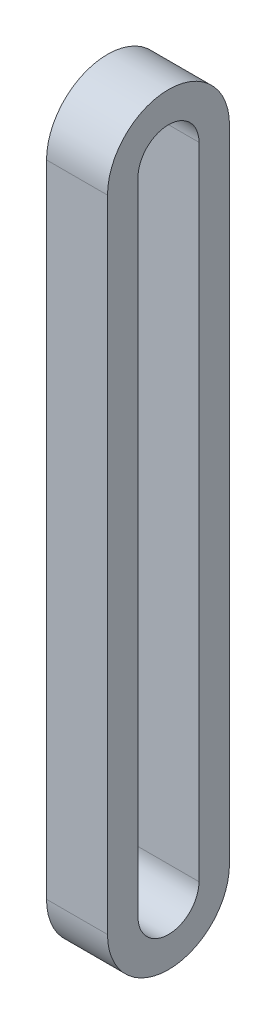
ISO-10303-21;
HEADER;
FILE_DESCRIPTION(('STEP AP214'),'2;1');
FILE_NAME('part.step','',(''),(''),'','','');
FILE_SCHEMA(('AUTOMOTIVE_DESIGN { 1 0 10303 214 1 1 1 1 }'));
ENDSEC;
DATA;
#1=APPLICATION_CONTEXT('core data for automotive mechanical design processes');
#2=APPLICATION_PROTOCOL_DEFINITION('international standard','automotive_design',2000,#1);
#3=PRODUCT_CONTEXT('',#1,'mechanical');
#4=PRODUCT('Part','Part','',(#3));
#5=PRODUCT_RELATED_PRODUCT_CATEGORY('part','',(#4));
#6=PRODUCT_DEFINITION_FORMATION('','',#4);
#7=PRODUCT_DEFINITION_CONTEXT('part definition',#1,'design');
#8=PRODUCT_DEFINITION('design','',#6,#7);
#9=PRODUCT_DEFINITION_SHAPE('','',#8);
#10=(LENGTH_UNIT() NAMED_UNIT(*) SI_UNIT(.MILLI.,.METRE.));
#11=(NAMED_UNIT(*) PLANE_ANGLE_UNIT() SI_UNIT($,.RADIAN.));
#12=(NAMED_UNIT(*) SI_UNIT($,.STERADIAN.) SOLID_ANGLE_UNIT());
#13=UNCERTAINTY_MEASURE_WITH_UNIT(LENGTH_MEASURE(1.E-05),#10,'distance_accuracy_value','');
#14=(GEOMETRIC_REPRESENTATION_CONTEXT(3) GLOBAL_UNCERTAINTY_ASSIGNED_CONTEXT((#13)) GLOBAL_UNIT_ASSIGNED_CONTEXT((#10,
#11,#12)) REPRESENTATION_CONTEXT('',''));
#15=CARTESIAN_POINT('',(0.,0.,0.));
#16=DIRECTION('',(0.,0.,1.));
#17=DIRECTION('',(1.,0.,0.));
#18=AXIS2_PLACEMENT_3D('',#15,#16,#17);
#19=CARTESIAN_POINT('',(30.,25.,0.));
#20=DIRECTION('',(1.,0.,0.));
#21=DIRECTION('',(0.,1.,0.));
#22=AXIS2_PLACEMENT_3D('',#19,#20,#21);
#23=PLANE('',#22);
#24=DIRECTION('',(0.,-1.,0.));
#25=VECTOR('',#24,1.);
#26=CARTESIAN_POINT('',(30.,130.,-10.));
#27=LINE('',#26,#25);
#28=CARTESIAN_POINT('',(30.,130.,-10.));
#29=VERTEX_POINT('',#28);
#30=CARTESIAN_POINT('',(30.,25.,-10.));
#31=VERTEX_POINT('',#30);
#32=EDGE_CURVE('E161',#29,#31,#27,.T.);
#33=ORIENTED_EDGE('',*,*,#32,.F.);
#34=CARTESIAN_POINT('',(30.,130.,0.));
#35=DIRECTION('',(1.,0.,0.));
#36=DIRECTION('',(0.,1.,0.));
#37=AXIS2_PLACEMENT_3D('',#34,#35,#36);
#38=CIRCLE('',#37,10.);
#39=CARTESIAN_POINT('',(30.,130.,10.));
#40=VERTEX_POINT('',#39);
#41=EDGE_CURVE('E169',#29,#40,#38,.T.);
#42=ORIENTED_EDGE('',*,*,#41,.T.);
#43=DIRECTION('',(0.,-1.,0.));
#44=VECTOR('',#43,1.);
#45=CARTESIAN_POINT('',(30.,130.,10.));
#46=LINE('',#45,#44);
#47=CARTESIAN_POINT('',(30.,25.,9.99999999999998));
#48=VERTEX_POINT('',#47);
#49=EDGE_CURVE('E167',#40,#48,#46,.T.);
#50=ORIENTED_EDGE('',*,*,#49,.T.);
#51=CARTESIAN_POINT('',(30.,25.,0.));
#52=DIRECTION('',(1.,0.,0.));
#53=DIRECTION('',(0.,1.,0.));
#54=AXIS2_PLACEMENT_3D('',#51,#52,#53);
#55=CIRCLE('',#54,10.);
#56=EDGE_CURVE('E164',#48,#31,#55,.T.);
#57=ORIENTED_EDGE('',*,*,#56,.T.);
#58=EDGE_LOOP('',(#33,#42,#50,#57));
#59=FACE_BOUND('',#58,.T.);
#60=DIRECTION('',(0.,-1.,0.));
#61=VECTOR('',#60,1.);
#62=CARTESIAN_POINT('',(30.,130.,5.));
#63=LINE('',#62,#61);
#64=CARTESIAN_POINT('',(30.,130.,5.));
#65=VERTEX_POINT('',#64);
#66=CARTESIAN_POINT('',(30.,25.,4.99999999999999));
#67=VERTEX_POINT('',#66);
#68=EDGE_CURVE('E134',#65,#67,#63,.T.);
#69=ORIENTED_EDGE('',*,*,#68,.F.);
#70=CARTESIAN_POINT('',(30.,130.,0.));
#71=DIRECTION('',(1.,0.,0.));
#72=DIRECTION('',(0.,1.,0.));
#73=AXIS2_PLACEMENT_3D('',#70,#71,#72);
#74=CIRCLE('',#73,5.);
#75=CARTESIAN_POINT('',(30.,130.,-5.));
#76=VERTEX_POINT('',#75);
#77=EDGE_CURVE('E126',#76,#65,#74,.T.);
#78=ORIENTED_EDGE('',*,*,#77,.F.);
#79=DIRECTION('',(0.,-1.,0.));
#80=VECTOR('',#79,1.);
#81=CARTESIAN_POINT('',(30.,130.,-5.));
#82=LINE('',#81,#80);
#83=CARTESIAN_POINT('',(30.,25.,-5.00000000000002));
#84=VERTEX_POINT('',#83);
#85=EDGE_CURVE('E148',#76,#84,#82,.T.);
#86=ORIENTED_EDGE('',*,*,#85,.T.);
#87=CARTESIAN_POINT('',(30.,25.,0.));
#88=DIRECTION('',(1.,0.,0.));
#89=DIRECTION('',(0.,1.,0.));
#90=AXIS2_PLACEMENT_3D('',#87,#88,#89);
#91=CIRCLE('',#90,5.);
#92=EDGE_CURVE('E146',#67,#84,#91,.T.);
#93=ORIENTED_EDGE('',*,*,#92,.F.);
#94=EDGE_LOOP('',(#69,#78,#86,#93));
#95=FACE_BOUND('',#94,.T.);
#96=ADVANCED_FACE('F60',(#59,#95),#23,.T.);
#97=CARTESIAN_POINT('',(20.,25.,0.));
#98=DIRECTION('',(1.,0.,0.));
#99=DIRECTION('',(0.,1.,0.));
#100=AXIS2_PLACEMENT_3D('',#97,#98,#99);
#101=PLANE('',#100);
#102=DIRECTION('',(0.,-1.,0.));
#103=VECTOR('',#102,1.);
#104=CARTESIAN_POINT('',(20.,130.,-10.));
#105=LINE('',#104,#103);
#106=CARTESIAN_POINT('',(20.,130.,-10.));
#107=VERTEX_POINT('',#106);
#108=CARTESIAN_POINT('',(20.,25.,-10.));
#109=VERTEX_POINT('',#108);
#110=EDGE_CURVE('E142',#107,#109,#105,.T.);
#111=ORIENTED_EDGE('',*,*,#110,.T.);
#112=CARTESIAN_POINT('',(20.,25.,0.));
#113=DIRECTION('',(1.,0.,0.));
#114=DIRECTION('',(0.,1.,0.));
#115=AXIS2_PLACEMENT_3D('',#112,#113,#114);
#116=CIRCLE('',#115,10.);
#117=CARTESIAN_POINT('',(20.,25.,9.99999999999998));
#118=VERTEX_POINT('',#117);
#119=EDGE_CURVE('E173',#118,#109,#116,.T.);
#120=ORIENTED_EDGE('',*,*,#119,.F.);
#121=DIRECTION('',(0.,-1.,0.));
#122=VECTOR('',#121,1.);
#123=CARTESIAN_POINT('',(20.,130.,10.));
#124=LINE('',#123,#122);
#125=CARTESIAN_POINT('',(20.,130.,10.));
#126=VERTEX_POINT('',#125);
#127=EDGE_CURVE('E176',#126,#118,#124,.T.);
#128=ORIENTED_EDGE('',*,*,#127,.F.);
#129=CARTESIAN_POINT('',(20.,130.,0.));
#130=DIRECTION('',(1.,0.,0.));
#131=DIRECTION('',(0.,1.,0.));
#132=AXIS2_PLACEMENT_3D('',#129,#130,#131);
#133=CIRCLE('',#132,10.);
#134=EDGE_CURVE('E165',#107,#126,#133,.T.);
#135=ORIENTED_EDGE('',*,*,#134,.F.);
#136=EDGE_LOOP('',(#111,#120,#128,#135));
#137=FACE_BOUND('',#136,.T.);
#138=CARTESIAN_POINT('',(20.,130.,0.));
#139=DIRECTION('',(1.,0.,0.));
#140=DIRECTION('',(0.,1.,0.));
#141=AXIS2_PLACEMENT_3D('',#138,#139,#140);
#142=CIRCLE('',#141,5.);
#143=CARTESIAN_POINT('',(20.,130.,-5.));
#144=VERTEX_POINT('',#143);
#145=CARTESIAN_POINT('',(20.,130.,5.));
#146=VERTEX_POINT('',#145);
#147=EDGE_CURVE('E85',#144,#146,#142,.T.);
#148=ORIENTED_EDGE('',*,*,#147,.T.);
#149=DIRECTION('',(0.,-1.,0.));
#150=VECTOR('',#149,1.);
#151=CARTESIAN_POINT('',(20.,130.,5.));
#152=LINE('',#151,#150);
#153=CARTESIAN_POINT('',(20.,25.,4.99999999999999));
#154=VERTEX_POINT('',#153);
#155=EDGE_CURVE('E141',#146,#154,#152,.T.);
#156=ORIENTED_EDGE('',*,*,#155,.T.);
#157=CARTESIAN_POINT('',(20.,25.,0.));
#158=DIRECTION('',(1.,0.,0.));
#159=DIRECTION('',(0.,1.,0.));
#160=AXIS2_PLACEMENT_3D('',#157,#158,#159);
#161=CIRCLE('',#160,5.);
#162=CARTESIAN_POINT('',(20.,25.,-5.00000000000002));
#163=VERTEX_POINT('',#162);
#164=EDGE_CURVE('E154',#154,#163,#161,.T.);
#165=ORIENTED_EDGE('',*,*,#164,.T.);
#166=DIRECTION('',(0.,-1.,0.));
#167=VECTOR('',#166,1.);
#168=CARTESIAN_POINT('',(20.,130.,-5.));
#169=LINE('',#168,#167);
#170=EDGE_CURVE('E135',#144,#163,#169,.T.);
#171=ORIENTED_EDGE('',*,*,#170,.F.);
#172=EDGE_LOOP('',(#148,#156,#165,#171));
#173=FACE_BOUND('',#172,.T.);
#174=ADVANCED_FACE('F194',(#137,#173),#101,.F.);
#175=CARTESIAN_POINT('',(30.,130.,-10.));
#176=DIRECTION('',(0.,0.,-1.));
#177=DIRECTION('',(0.,1.,0.));
#178=AXIS2_PLACEMENT_3D('',#175,#176,#177);
#179=PLANE('',#178);
#180=ORIENTED_EDGE('',*,*,#110,.F.);
#181=DIRECTION('',(-1.,0.,0.));
#182=VECTOR('',#181,1.);
#183=CARTESIAN_POINT('',(30.,130.,-10.));
#184=LINE('',#183,#182);
#185=EDGE_CURVE('E12',#29,#107,#184,.T.);
#186=ORIENTED_EDGE('',*,*,#185,.F.);
#187=ORIENTED_EDGE('',*,*,#32,.T.);
#188=DIRECTION('',(-1.,0.,0.));
#189=VECTOR('',#188,1.);
#190=CARTESIAN_POINT('',(30.,25.,-10.));
#191=LINE('',#190,#189);
#192=EDGE_CURVE('E64',#31,#109,#191,.T.);
#193=ORIENTED_EDGE('',*,*,#192,.T.);
#194=EDGE_LOOP('',(#180,#186,#187,#193));
#195=FACE_BOUND('',#194,.T.);
#196=ADVANCED_FACE('F62',(#195),#179,.T.);
#197=CARTESIAN_POINT('',(30.,130.,0.));
#198=DIRECTION('',(-1.,0.,0.));
#199=DIRECTION('',(0.,-1.,0.));
#200=AXIS2_PLACEMENT_3D('',#197,#198,#199);
#201=CYLINDRICAL_SURFACE('',#200,10.);
#202=ORIENTED_EDGE('',*,*,#134,.T.);
#203=DIRECTION('',(-1.,0.,0.));
#204=VECTOR('',#203,1.);
#205=CARTESIAN_POINT('',(30.,130.,10.));
#206=LINE('',#205,#204);
#207=EDGE_CURVE('E69',#40,#126,#206,.T.);
#208=ORIENTED_EDGE('',*,*,#207,.F.);
#209=ORIENTED_EDGE('',*,*,#41,.F.);
#210=ORIENTED_EDGE('',*,*,#185,.T.);
#211=EDGE_LOOP('',(#202,#208,#209,#210));
#212=FACE_BOUND('',#211,.T.);
#213=ADVANCED_FACE('F198',(#212),#201,.T.);
#214=CARTESIAN_POINT('',(30.,130.,10.));
#215=DIRECTION('',(0.,0.,-1.));
#216=DIRECTION('',(0.,1.,0.));
#217=AXIS2_PLACEMENT_3D('',#214,#215,#216);
#218=PLANE('',#217);
#219=ORIENTED_EDGE('',*,*,#127,.T.);
#220=DIRECTION('',(-1.,0.,0.));
#221=VECTOR('',#220,1.);
#222=CARTESIAN_POINT('',(30.,25.,9.99999999999998));
#223=LINE('',#222,#221);
#224=EDGE_CURVE('E180',#48,#118,#223,.T.);
#225=ORIENTED_EDGE('',*,*,#224,.F.);
#226=ORIENTED_EDGE('',*,*,#49,.F.);
#227=ORIENTED_EDGE('',*,*,#207,.T.);
#228=EDGE_LOOP('',(#219,#225,#226,#227));
#229=FACE_BOUND('',#228,.T.);
#230=ADVANCED_FACE('F202',(#229),#218,.F.);
#231=CARTESIAN_POINT('',(30.,25.,0.));
#232=DIRECTION('',(-1.,0.,0.));
#233=DIRECTION('',(0.,-1.,0.));
#234=AXIS2_PLACEMENT_3D('',#231,#232,#233);
#235=CYLINDRICAL_SURFACE('',#234,10.);
#236=ORIENTED_EDGE('',*,*,#119,.T.);
#237=ORIENTED_EDGE('',*,*,#192,.F.);
#238=ORIENTED_EDGE('',*,*,#56,.F.);
#239=ORIENTED_EDGE('',*,*,#224,.T.);
#240=EDGE_LOOP('',(#236,#237,#238,#239));
#241=FACE_BOUND('',#240,.T.);
#242=ADVANCED_FACE('F190',(#241),#235,.T.);
#243=CARTESIAN_POINT('',(30.,130.,0.));
#244=DIRECTION('',(-1.,0.,0.));
#245=DIRECTION('',(0.,-1.,0.));
#246=AXIS2_PLACEMENT_3D('',#243,#244,#245);
#247=CYLINDRICAL_SURFACE('',#246,5.);
#248=ORIENTED_EDGE('',*,*,#147,.F.);
#249=DIRECTION('',(-1.,0.,0.));
#250=VECTOR('',#249,1.);
#251=CARTESIAN_POINT('',(30.,130.,-5.));
#252=LINE('',#251,#250);
#253=EDGE_CURVE('E130',#76,#144,#252,.T.);
#254=ORIENTED_EDGE('',*,*,#253,.F.);
#255=ORIENTED_EDGE('',*,*,#77,.T.);
#256=DIRECTION('',(-1.,0.,0.));
#257=VECTOR('',#256,1.);
#258=CARTESIAN_POINT('',(30.,130.,5.));
#259=LINE('',#258,#257);
#260=EDGE_CURVE('E129',#65,#146,#259,.T.);
#261=ORIENTED_EDGE('',*,*,#260,.T.);
#262=EDGE_LOOP('',(#248,#254,#255,#261));
#263=FACE_BOUND('',#262,.T.);
#264=ADVANCED_FACE('F128',(#263),#247,.F.);
#265=CARTESIAN_POINT('',(30.,130.,5.));
#266=DIRECTION('',(0.,0.,-1.));
#267=DIRECTION('',(0.,1.,0.));
#268=AXIS2_PLACEMENT_3D('',#265,#266,#267);
#269=PLANE('',#268);
#270=ORIENTED_EDGE('',*,*,#155,.F.);
#271=ORIENTED_EDGE('',*,*,#260,.F.);
#272=ORIENTED_EDGE('',*,*,#68,.T.);
#273=DIRECTION('',(-1.,0.,0.));
#274=VECTOR('',#273,1.);
#275=CARTESIAN_POINT('',(30.,25.,4.99999999999999));
#276=LINE('',#275,#274);
#277=EDGE_CURVE('E143',#67,#154,#276,.T.);
#278=ORIENTED_EDGE('',*,*,#277,.T.);
#279=EDGE_LOOP('',(#270,#271,#272,#278));
#280=FACE_BOUND('',#279,.T.);
#281=ADVANCED_FACE('F138',(#280),#269,.T.);
#282=CARTESIAN_POINT('',(30.,25.,0.));
#283=DIRECTION('',(-1.,0.,0.));
#284=DIRECTION('',(0.,-1.,0.));
#285=AXIS2_PLACEMENT_3D('',#282,#283,#284);
#286=CYLINDRICAL_SURFACE('',#285,5.);
#287=ORIENTED_EDGE('',*,*,#164,.F.);
#288=ORIENTED_EDGE('',*,*,#277,.F.);
#289=ORIENTED_EDGE('',*,*,#92,.T.);
#290=DIRECTION('',(-1.,0.,0.));
#291=VECTOR('',#290,1.);
#292=CARTESIAN_POINT('',(30.,25.,-5.00000000000002));
#293=LINE('',#292,#291);
#294=EDGE_CURVE('E77',#84,#163,#293,.T.);
#295=ORIENTED_EDGE('',*,*,#294,.T.);
#296=EDGE_LOOP('',(#287,#288,#289,#295));
#297=FACE_BOUND('',#296,.T.);
#298=ADVANCED_FACE('F223',(#297),#286,.F.);
#299=CARTESIAN_POINT('',(30.,130.,-5.));
#300=DIRECTION('',(0.,0.,-1.));
#301=DIRECTION('',(0.,1.,0.));
#302=AXIS2_PLACEMENT_3D('',#299,#300,#301);
#303=PLANE('',#302);
#304=ORIENTED_EDGE('',*,*,#170,.T.);
#305=ORIENTED_EDGE('',*,*,#294,.F.);
#306=ORIENTED_EDGE('',*,*,#85,.F.);
#307=ORIENTED_EDGE('',*,*,#253,.T.);
#308=EDGE_LOOP('',(#304,#305,#306,#307));
#309=FACE_BOUND('',#308,.T.);
#310=ADVANCED_FACE('F227',(#309),#303,.F.);
#311=CLOSED_SHELL('',(#96,#174,#196,#213,#230,#242,#264,#281,#298,#310));
#312=MANIFOLD_SOLID_BREP('B2',#311);
#313=ADVANCED_BREP_SHAPE_REPRESENTATION('',(#18,#312),#14);
#314=SHAPE_DEFINITION_REPRESENTATION(#9,#313);
ENDSEC;
END-ISO-10303-21;
